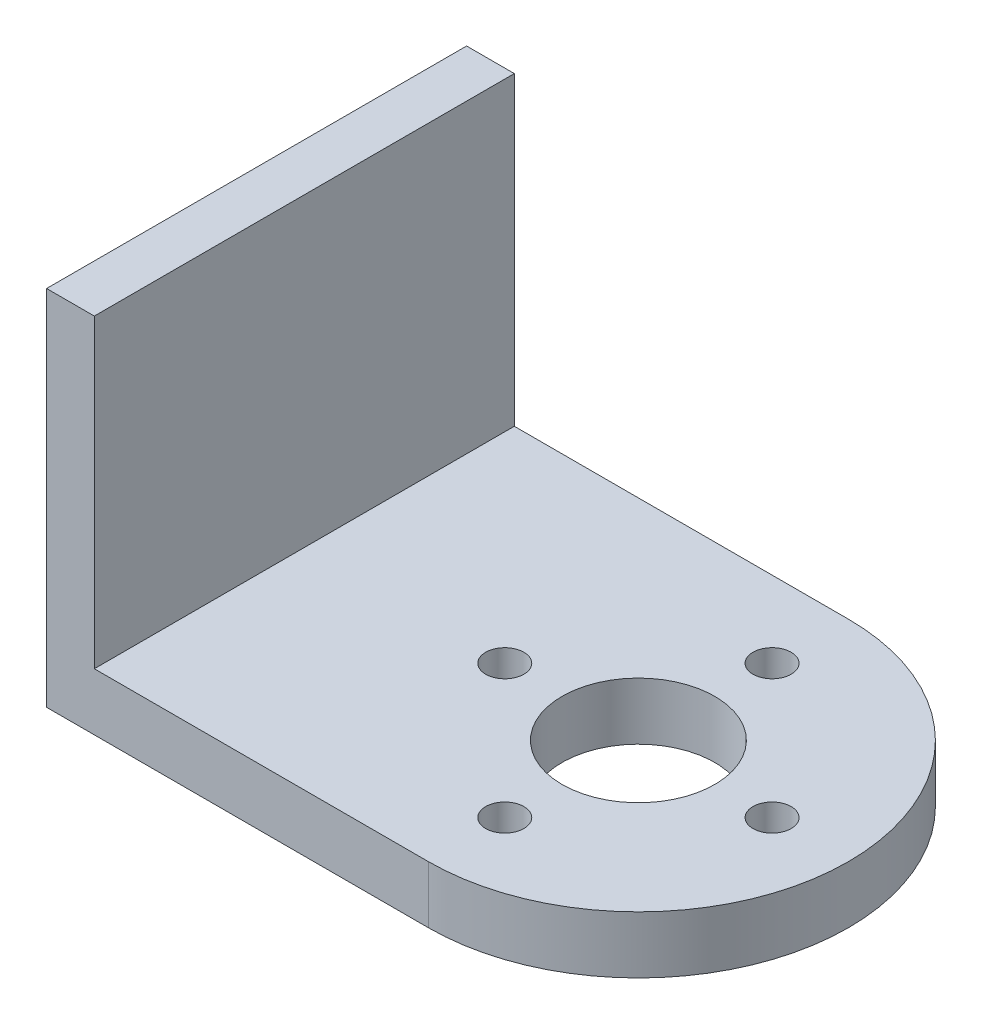
ISO-10303-21;
HEADER;
FILE_DESCRIPTION(('STEP AP214'),'2;1');
FILE_NAME('part.step','',(''),(''),'','','');
FILE_SCHEMA(('AUTOMOTIVE_DESIGN { 1 0 10303 214 1 1 1 1 }'));
ENDSEC;
DATA;
#1=APPLICATION_CONTEXT('core data for automotive mechanical design processes');
#2=APPLICATION_PROTOCOL_DEFINITION('international standard','automotive_design',2000,#1);
#3=PRODUCT_CONTEXT('',#1,'mechanical');
#4=PRODUCT('Part','Part','',(#3));
#5=PRODUCT_RELATED_PRODUCT_CATEGORY('part','',(#4));
#6=PRODUCT_DEFINITION_FORMATION('','',#4);
#7=PRODUCT_DEFINITION_CONTEXT('part definition',#1,'design');
#8=PRODUCT_DEFINITION('design','',#6,#7);
#9=PRODUCT_DEFINITION_SHAPE('','',#8);
#10=(LENGTH_UNIT() NAMED_UNIT(*) SI_UNIT(.MILLI.,.METRE.));
#11=(NAMED_UNIT(*) PLANE_ANGLE_UNIT() SI_UNIT($,.RADIAN.));
#12=(NAMED_UNIT(*) SI_UNIT($,.STERADIAN.) SOLID_ANGLE_UNIT());
#13=UNCERTAINTY_MEASURE_WITH_UNIT(LENGTH_MEASURE(1.E-05),#10,'distance_accuracy_value','');
#14=(GEOMETRIC_REPRESENTATION_CONTEXT(3) GLOBAL_UNCERTAINTY_ASSIGNED_CONTEXT((#13)) GLOBAL_UNIT_ASSIGNED_CONTEXT((#10,
#11,#12)) REPRESENTATION_CONTEXT('',''));
#15=CARTESIAN_POINT('',(0.,0.,0.));
#16=DIRECTION('',(0.,0.,1.));
#17=DIRECTION('',(1.,0.,0.));
#18=AXIS2_PLACEMENT_3D('',#15,#16,#17);
#19=CARTESIAN_POINT('',(6.,3.,0.));
#20=DIRECTION('',(0.,1.,0.));
#21=DIRECTION('',(0.,0.,1.));
#22=AXIS2_PLACEMENT_3D('',#19,#20,#21);
#23=PLANE('',#22);
#24=DIRECTION('',(0.,0.,-1.));
#25=VECTOR('',#24,1.);
#26=CARTESIAN_POINT('',(-11.5,3.,-11.));
#27=LINE('',#26,#25);
#28=CARTESIAN_POINT('',(-11.5,3.,11.));
#29=VERTEX_POINT('',#28);
#30=CARTESIAN_POINT('',(-11.5,3.,-11.));
#31=VERTEX_POINT('',#30);
#32=EDGE_CURVE('E53',#29,#31,#27,.T.);
#33=ORIENTED_EDGE('',*,*,#32,.F.);
#34=DIRECTION('',(1.,0.,0.));
#35=VECTOR('',#34,1.);
#36=CARTESIAN_POINT('',(6.,3.,11.));
#37=LINE('',#36,#35);
#38=CARTESIAN_POINT('',(6.,3.,11.));
#39=VERTEX_POINT('',#38);
#40=EDGE_CURVE('E91',#29,#39,#37,.T.);
#41=ORIENTED_EDGE('',*,*,#40,.T.);
#42=CARTESIAN_POINT('',(6.,3.,0.));
#43=DIRECTION('',(0.,1.,0.));
#44=DIRECTION('',(0.,0.,1.));
#45=AXIS2_PLACEMENT_3D('',#42,#43,#44);
#46=CIRCLE('',#45,11.);
#47=CARTESIAN_POINT('',(6.,3.,-11.));
#48=VERTEX_POINT('',#47);
#49=EDGE_CURVE('E59',#39,#48,#46,.T.);
#50=ORIENTED_EDGE('',*,*,#49,.T.);
#51=DIRECTION('',(-1.,0.,0.));
#52=VECTOR('',#51,1.);
#53=CARTESIAN_POINT('',(-14.,3.,-11.));
#54=LINE('',#53,#52);
#55=EDGE_CURVE('E102',#48,#31,#54,.T.);
#56=ORIENTED_EDGE('',*,*,#55,.T.);
#57=EDGE_LOOP('',(#33,#41,#50,#56));
#58=FACE_BOUND('',#57,.T.);
#59=CARTESIAN_POINT('',(-1.,3.,0.));
#60=DIRECTION('',(0.,1.,0.));
#61=DIRECTION('',(0.,0.,1.));
#62=AXIS2_PLACEMENT_3D('',#59,#60,#61);
#63=CIRCLE('',#62,1.);
#64=CARTESIAN_POINT('',(-1.,3.,0.999999999999951));
#65=VERTEX_POINT('',#64);
#66=EDGE_CURVE('E148',#65,#65,#63,.T.);
#67=ORIENTED_EDGE('',*,*,#66,.F.);
#68=EDGE_LOOP('',(#67));
#69=FACE_BOUND('',#68,.T.);
#70=CARTESIAN_POINT('',(6.,3.,0.));
#71=DIRECTION('',(0.,1.,0.));
#72=DIRECTION('',(0.,0.,1.));
#73=AXIS2_PLACEMENT_3D('',#70,#71,#72);
#74=CIRCLE('',#73,4.);
#75=CARTESIAN_POINT('',(6.,3.,4.));
#76=VERTEX_POINT('',#75);
#77=EDGE_CURVE('E160',#76,#76,#74,.T.);
#78=ORIENTED_EDGE('',*,*,#77,.F.);
#79=EDGE_LOOP('',(#78));
#80=FACE_BOUND('',#79,.T.);
#81=CARTESIAN_POINT('',(13.,3.,0.));
#82=DIRECTION('',(0.,1.,0.));
#83=DIRECTION('',(0.,0.,1.));
#84=AXIS2_PLACEMENT_3D('',#81,#82,#83);
#85=CIRCLE('',#84,1.);
#86=CARTESIAN_POINT('',(13.,3.,1.));
#87=VERTEX_POINT('',#86);
#88=EDGE_CURVE('E107',#87,#87,#85,.T.);
#89=ORIENTED_EDGE('',*,*,#88,.F.);
#90=EDGE_LOOP('',(#89));
#91=FACE_BOUND('',#90,.T.);
#92=CARTESIAN_POINT('',(5.99999999999998,3.,7.));
#93=DIRECTION('',(0.,1.,0.));
#94=DIRECTION('',(0.,0.,1.));
#95=AXIS2_PLACEMENT_3D('',#92,#93,#94);
#96=CIRCLE('',#95,1.);
#97=CARTESIAN_POINT('',(5.99999999999998,3.,8.));
#98=VERTEX_POINT('',#97);
#99=EDGE_CURVE('E154',#98,#98,#96,.T.);
#100=ORIENTED_EDGE('',*,*,#99,.F.);
#101=EDGE_LOOP('',(#100));
#102=FACE_BOUND('',#101,.T.);
#103=CARTESIAN_POINT('',(6.00000000000008,3.,-7.));
#104=DIRECTION('',(0.,1.,0.));
#105=DIRECTION('',(0.,0.,1.));
#106=AXIS2_PLACEMENT_3D('',#103,#104,#105);
#107=CIRCLE('',#106,1.);
#108=CARTESIAN_POINT('',(6.00000000000008,3.,-6.));
#109=VERTEX_POINT('',#108);
#110=EDGE_CURVE('E139',#109,#109,#107,.T.);
#111=ORIENTED_EDGE('',*,*,#110,.F.);
#112=EDGE_LOOP('',(#111));
#113=FACE_BOUND('',#112,.T.);
#114=ADVANCED_FACE('F38',(#58,#69,#80,#91,#102,#113),#23,.T.);
#115=CARTESIAN_POINT('',(6.,0.,0.));
#116=DIRECTION('',(0.,1.,0.));
#117=DIRECTION('',(0.,0.,1.));
#118=AXIS2_PLACEMENT_3D('',#115,#116,#117);
#119=PLANE('',#118);
#120=DIRECTION('',(1.,0.,0.));
#121=VECTOR('',#120,1.);
#122=CARTESIAN_POINT('',(6.,0.,11.));
#123=LINE('',#122,#121);
#124=CARTESIAN_POINT('',(-14.,0.,11.));
#125=VERTEX_POINT('',#124);
#126=CARTESIAN_POINT('',(6.,0.,11.));
#127=VERTEX_POINT('',#126);
#128=EDGE_CURVE('E97',#125,#127,#123,.T.);
#129=ORIENTED_EDGE('',*,*,#128,.F.);
#130=DIRECTION('',(0.,0.,1.));
#131=VECTOR('',#130,1.);
#132=CARTESIAN_POINT('',(-14.,0.,11.));
#133=LINE('',#132,#131);
#134=CARTESIAN_POINT('',(-14.,0.,-11.));
#135=VERTEX_POINT('',#134);
#136=EDGE_CURVE('E79',#135,#125,#133,.T.);
#137=ORIENTED_EDGE('',*,*,#136,.F.);
#138=DIRECTION('',(-1.,0.,0.));
#139=VECTOR('',#138,1.);
#140=CARTESIAN_POINT('',(-14.,0.,-11.));
#141=LINE('',#140,#139);
#142=CARTESIAN_POINT('',(6.,0.,-11.));
#143=VERTEX_POINT('',#142);
#144=EDGE_CURVE('E92',#143,#135,#141,.T.);
#145=ORIENTED_EDGE('',*,*,#144,.F.);
#146=CARTESIAN_POINT('',(6.,0.,0.));
#147=DIRECTION('',(0.,1.,0.));
#148=DIRECTION('',(0.,0.,1.));
#149=AXIS2_PLACEMENT_3D('',#146,#147,#148);
#150=CIRCLE('',#149,11.);
#151=EDGE_CURVE('E106',#127,#143,#150,.T.);
#152=ORIENTED_EDGE('',*,*,#151,.F.);
#153=EDGE_LOOP('',(#129,#137,#145,#152));
#154=FACE_BOUND('',#153,.T.);
#155=CARTESIAN_POINT('',(13.,0.,0.));
#156=DIRECTION('',(0.,1.,0.));
#157=DIRECTION('',(0.,0.,1.));
#158=AXIS2_PLACEMENT_3D('',#155,#156,#157);
#159=CIRCLE('',#158,1.);
#160=CARTESIAN_POINT('',(13.,0.,1.));
#161=VERTEX_POINT('',#160);
#162=EDGE_CURVE('E111',#161,#161,#159,.T.);
#163=ORIENTED_EDGE('',*,*,#162,.T.);
#164=EDGE_LOOP('',(#163));
#165=FACE_BOUND('',#164,.T.);
#166=CARTESIAN_POINT('',(6.,0.,0.));
#167=DIRECTION('',(0.,1.,0.));
#168=DIRECTION('',(0.,0.,1.));
#169=AXIS2_PLACEMENT_3D('',#166,#167,#168);
#170=CIRCLE('',#169,4.);
#171=CARTESIAN_POINT('',(6.,0.,4.));
#172=VERTEX_POINT('',#171);
#173=EDGE_CURVE('E157',#172,#172,#170,.T.);
#174=ORIENTED_EDGE('',*,*,#173,.T.);
#175=EDGE_LOOP('',(#174));
#176=FACE_BOUND('',#175,.T.);
#177=CARTESIAN_POINT('',(5.99999999999998,0.,7.));
#178=DIRECTION('',(0.,1.,0.));
#179=DIRECTION('',(0.,0.,1.));
#180=AXIS2_PLACEMENT_3D('',#177,#178,#179);
#181=CIRCLE('',#180,1.);
#182=CARTESIAN_POINT('',(5.99999999999998,0.,8.));
#183=VERTEX_POINT('',#182);
#184=EDGE_CURVE('E151',#183,#183,#181,.T.);
#185=ORIENTED_EDGE('',*,*,#184,.T.);
#186=EDGE_LOOP('',(#185));
#187=FACE_BOUND('',#186,.T.);
#188=CARTESIAN_POINT('',(-1.,0.,0.));
#189=DIRECTION('',(0.,1.,0.));
#190=DIRECTION('',(0.,0.,1.));
#191=AXIS2_PLACEMENT_3D('',#188,#189,#190);
#192=CIRCLE('',#191,1.);
#193=CARTESIAN_POINT('',(-1.,0.,0.999999999999951));
#194=VERTEX_POINT('',#193);
#195=EDGE_CURVE('E146',#194,#194,#192,.T.);
#196=ORIENTED_EDGE('',*,*,#195,.T.);
#197=EDGE_LOOP('',(#196));
#198=FACE_BOUND('',#197,.T.);
#199=CARTESIAN_POINT('',(6.00000000000008,0.,-7.));
#200=DIRECTION('',(0.,1.,0.));
#201=DIRECTION('',(0.,0.,1.));
#202=AXIS2_PLACEMENT_3D('',#199,#200,#201);
#203=CIRCLE('',#202,1.);
#204=CARTESIAN_POINT('',(6.00000000000008,0.,-6.));
#205=VERTEX_POINT('',#204);
#206=EDGE_CURVE('E135',#205,#205,#203,.T.);
#207=ORIENTED_EDGE('',*,*,#206,.T.);
#208=EDGE_LOOP('',(#207));
#209=FACE_BOUND('',#208,.T.);
#210=ADVANCED_FACE('F104',(#154,#165,#176,#187,#198,#209),#119,.F.);
#211=CARTESIAN_POINT('',(6.,3.,11.));
#212=DIRECTION('',(0.,0.,-1.));
#213=DIRECTION('',(-1.,0.,0.));
#214=AXIS2_PLACEMENT_3D('',#211,#212,#213);
#215=PLANE('',#214);
#216=ORIENTED_EDGE('',*,*,#128,.T.);
#217=DIRECTION('',(0.,-1.,0.));
#218=VECTOR('',#217,1.);
#219=CARTESIAN_POINT('',(6.,3.,11.));
#220=LINE('',#219,#218);
#221=EDGE_CURVE('E11',#39,#127,#220,.T.);
#222=ORIENTED_EDGE('',*,*,#221,.F.);
#223=ORIENTED_EDGE('',*,*,#40,.F.);
#224=DIRECTION('',(0.,-1.,0.));
#225=VECTOR('',#224,1.);
#226=CARTESIAN_POINT('',(-11.5,19.,11.));
#227=LINE('',#226,#225);
#228=CARTESIAN_POINT('',(-11.5,19.,11.));
#229=VERTEX_POINT('',#228);
#230=EDGE_CURVE('E126',#229,#29,#227,.T.);
#231=ORIENTED_EDGE('',*,*,#230,.F.);
#232=DIRECTION('',(1.,0.,0.));
#233=VECTOR('',#232,1.);
#234=CARTESIAN_POINT('',(-11.5,19.,11.));
#235=LINE('',#234,#233);
#236=CARTESIAN_POINT('',(-14.,19.,11.));
#237=VERTEX_POINT('',#236);
#238=EDGE_CURVE('E100',#237,#229,#235,.T.);
#239=ORIENTED_EDGE('',*,*,#238,.F.);
#240=DIRECTION('',(0.,-1.,0.));
#241=VECTOR('',#240,1.);
#242=CARTESIAN_POINT('',(-14.,3.,11.));
#243=LINE('',#242,#241);
#244=EDGE_CURVE('E84',#237,#125,#243,.T.);
#245=ORIENTED_EDGE('',*,*,#244,.T.);
#246=EDGE_LOOP('',(#216,#222,#223,#231,#239,#245));
#247=FACE_BOUND('',#246,.T.);
#248=ADVANCED_FACE('F40',(#247),#215,.F.);
#249=CARTESIAN_POINT('',(6.,3.,0.));
#250=DIRECTION('',(0.,-1.,0.));
#251=DIRECTION('',(0.,0.,-1.));
#252=AXIS2_PLACEMENT_3D('',#249,#250,#251);
#253=CYLINDRICAL_SURFACE('',#252,11.);
#254=ORIENTED_EDGE('',*,*,#151,.T.);
#255=DIRECTION('',(0.,-1.,0.));
#256=VECTOR('',#255,1.);
#257=CARTESIAN_POINT('',(6.,3.,-11.));
#258=LINE('',#257,#256);
#259=EDGE_CURVE('E46',#48,#143,#258,.T.);
#260=ORIENTED_EDGE('',*,*,#259,.F.);
#261=ORIENTED_EDGE('',*,*,#49,.F.);
#262=ORIENTED_EDGE('',*,*,#221,.T.);
#263=EDGE_LOOP('',(#254,#260,#261,#262));
#264=FACE_BOUND('',#263,.T.);
#265=ADVANCED_FACE('F123',(#264),#253,.T.);
#266=CARTESIAN_POINT('',(-14.,3.,-11.));
#267=DIRECTION('',(0.,0.,1.));
#268=DIRECTION('',(1.,0.,0.));
#269=AXIS2_PLACEMENT_3D('',#266,#267,#268);
#270=PLANE('',#269);
#271=ORIENTED_EDGE('',*,*,#144,.T.);
#272=DIRECTION('',(0.,-1.,0.));
#273=VECTOR('',#272,1.);
#274=CARTESIAN_POINT('',(-14.,3.,-11.));
#275=LINE('',#274,#273);
#276=CARTESIAN_POINT('',(-14.,19.,-11.));
#277=VERTEX_POINT('',#276);
#278=EDGE_CURVE('E87',#277,#135,#275,.T.);
#279=ORIENTED_EDGE('',*,*,#278,.F.);
#280=DIRECTION('',(-1.,0.,0.));
#281=VECTOR('',#280,1.);
#282=CARTESIAN_POINT('',(-14.,19.,-11.));
#283=LINE('',#282,#281);
#284=CARTESIAN_POINT('',(-11.5,19.,-11.));
#285=VERTEX_POINT('',#284);
#286=EDGE_CURVE('E141',#285,#277,#283,.T.);
#287=ORIENTED_EDGE('',*,*,#286,.F.);
#288=DIRECTION('',(0.,-1.,0.));
#289=VECTOR('',#288,1.);
#290=CARTESIAN_POINT('',(-11.5,19.,-11.));
#291=LINE('',#290,#289);
#292=EDGE_CURVE('E136',#285,#31,#291,.T.);
#293=ORIENTED_EDGE('',*,*,#292,.T.);
#294=ORIENTED_EDGE('',*,*,#55,.F.);
#295=ORIENTED_EDGE('',*,*,#259,.T.);
#296=EDGE_LOOP('',(#271,#279,#287,#293,#294,#295));
#297=FACE_BOUND('',#296,.T.);
#298=ADVANCED_FACE('F120',(#297),#270,.F.);
#299=CARTESIAN_POINT('',(-14.,3.,11.));
#300=DIRECTION('',(1.,0.,0.));
#301=DIRECTION('',(0.,0.,-1.));
#302=AXIS2_PLACEMENT_3D('',#299,#300,#301);
#303=PLANE('',#302);
#304=ORIENTED_EDGE('',*,*,#136,.T.);
#305=ORIENTED_EDGE('',*,*,#244,.F.);
#306=DIRECTION('',(0.,0.,1.));
#307=VECTOR('',#306,1.);
#308=CARTESIAN_POINT('',(-14.,19.,-11.));
#309=LINE('',#308,#307);
#310=EDGE_CURVE('E175',#277,#237,#309,.T.);
#311=ORIENTED_EDGE('',*,*,#310,.F.);
#312=ORIENTED_EDGE('',*,*,#278,.T.);
#313=EDGE_LOOP('',(#304,#305,#311,#312));
#314=FACE_BOUND('',#313,.T.);
#315=ADVANCED_FACE('F81',(#314),#303,.F.);
#316=CARTESIAN_POINT('',(13.,3.,0.));
#317=DIRECTION('',(0.,-1.,0.));
#318=DIRECTION('',(0.,0.,-1.));
#319=AXIS2_PLACEMENT_3D('',#316,#317,#318);
#320=CYLINDRICAL_SURFACE('',#319,1.);
#321=ORIENTED_EDGE('',*,*,#88,.T.);
#322=EDGE_LOOP('',(#321));
#323=FACE_BOUND('',#322,.T.);
#324=ORIENTED_EDGE('',*,*,#162,.F.);
#325=EDGE_LOOP('',(#324));
#326=FACE_BOUND('',#325,.T.);
#327=ADVANCED_FACE('F195',(#323,#326),#320,.F.);
#328=CARTESIAN_POINT('',(6.,3.,0.));
#329=DIRECTION('',(0.,-1.,0.));
#330=DIRECTION('',(0.,0.,-1.));
#331=AXIS2_PLACEMENT_3D('',#328,#329,#330);
#332=CYLINDRICAL_SURFACE('',#331,4.);
#333=ORIENTED_EDGE('',*,*,#77,.T.);
#334=EDGE_LOOP('',(#333));
#335=FACE_BOUND('',#334,.T.);
#336=ORIENTED_EDGE('',*,*,#173,.F.);
#337=EDGE_LOOP('',(#336));
#338=FACE_BOUND('',#337,.T.);
#339=ADVANCED_FACE('F228',(#335,#338),#332,.F.);
#340=CARTESIAN_POINT('',(5.99999999999998,3.,7.));
#341=DIRECTION('',(0.,-1.,0.));
#342=DIRECTION('',(0.,0.,-1.));
#343=AXIS2_PLACEMENT_3D('',#340,#341,#342);
#344=CYLINDRICAL_SURFACE('',#343,1.);
#345=ORIENTED_EDGE('',*,*,#99,.T.);
#346=EDGE_LOOP('',(#345));
#347=FACE_BOUND('',#346,.T.);
#348=ORIENTED_EDGE('',*,*,#184,.F.);
#349=EDGE_LOOP('',(#348));
#350=FACE_BOUND('',#349,.T.);
#351=ADVANCED_FACE('F238',(#347,#350),#344,.F.);
#352=CARTESIAN_POINT('',(-1.,3.,0.));
#353=DIRECTION('',(0.,-1.,0.));
#354=DIRECTION('',(0.,0.,-1.));
#355=AXIS2_PLACEMENT_3D('',#352,#353,#354);
#356=CYLINDRICAL_SURFACE('',#355,1.);
#357=ORIENTED_EDGE('',*,*,#66,.T.);
#358=EDGE_LOOP('',(#357));
#359=FACE_BOUND('',#358,.T.);
#360=ORIENTED_EDGE('',*,*,#195,.F.);
#361=EDGE_LOOP('',(#360));
#362=FACE_BOUND('',#361,.T.);
#363=ADVANCED_FACE('F247',(#359,#362),#356,.F.);
#364=CARTESIAN_POINT('',(6.00000000000008,3.,-7.));
#365=DIRECTION('',(0.,-1.,0.));
#366=DIRECTION('',(0.,0.,-1.));
#367=AXIS2_PLACEMENT_3D('',#364,#365,#366);
#368=CYLINDRICAL_SURFACE('',#367,1.);
#369=ORIENTED_EDGE('',*,*,#110,.T.);
#370=EDGE_LOOP('',(#369));
#371=FACE_BOUND('',#370,.T.);
#372=ORIENTED_EDGE('',*,*,#206,.F.);
#373=EDGE_LOOP('',(#372));
#374=FACE_BOUND('',#373,.T.);
#375=ADVANCED_FACE('F186',(#371,#374),#368,.F.);
#376=CARTESIAN_POINT('',(-11.5,19.,-11.));
#377=DIRECTION('',(-1.,0.,0.));
#378=DIRECTION('',(0.,0.,1.));
#379=AXIS2_PLACEMENT_3D('',#376,#377,#378);
#380=PLANE('',#379);
#381=ORIENTED_EDGE('',*,*,#32,.T.);
#382=ORIENTED_EDGE('',*,*,#292,.F.);
#383=DIRECTION('',(0.,0.,-1.));
#384=VECTOR('',#383,1.);
#385=CARTESIAN_POINT('',(-11.5,19.,-11.));
#386=LINE('',#385,#384);
#387=EDGE_CURVE('E134',#229,#285,#386,.T.);
#388=ORIENTED_EDGE('',*,*,#387,.F.);
#389=ORIENTED_EDGE('',*,*,#230,.T.);
#390=EDGE_LOOP('',(#381,#382,#388,#389));
#391=FACE_BOUND('',#390,.T.);
#392=ADVANCED_FACE('F130',(#391),#380,.F.);
#393=CARTESIAN_POINT('',(0.,19.,0.));
#394=DIRECTION('',(0.,-1.,0.));
#395=DIRECTION('',(0.,0.,-1.));
#396=AXIS2_PLACEMENT_3D('',#393,#394,#395);
#397=PLANE('',#396);
#398=ORIENTED_EDGE('',*,*,#310,.T.);
#399=ORIENTED_EDGE('',*,*,#238,.T.);
#400=ORIENTED_EDGE('',*,*,#387,.T.);
#401=ORIENTED_EDGE('',*,*,#286,.T.);
#402=EDGE_LOOP('',(#398,#399,#400,#401));
#403=FACE_BOUND('',#402,.T.);
#404=ADVANCED_FACE('F173',(#403),#397,.F.);
#405=CLOSED_SHELL('',(#114,#210,#248,#265,#298,#315,#327,#339,#351,#363,#375,#392,#404));
#406=MANIFOLD_SOLID_BREP('B2',#405);
#407=ADVANCED_BREP_SHAPE_REPRESENTATION('',(#18,#406),#14);
#408=SHAPE_DEFINITION_REPRESENTATION(#9,#407);
ENDSEC;
END-ISO-10303-21;
